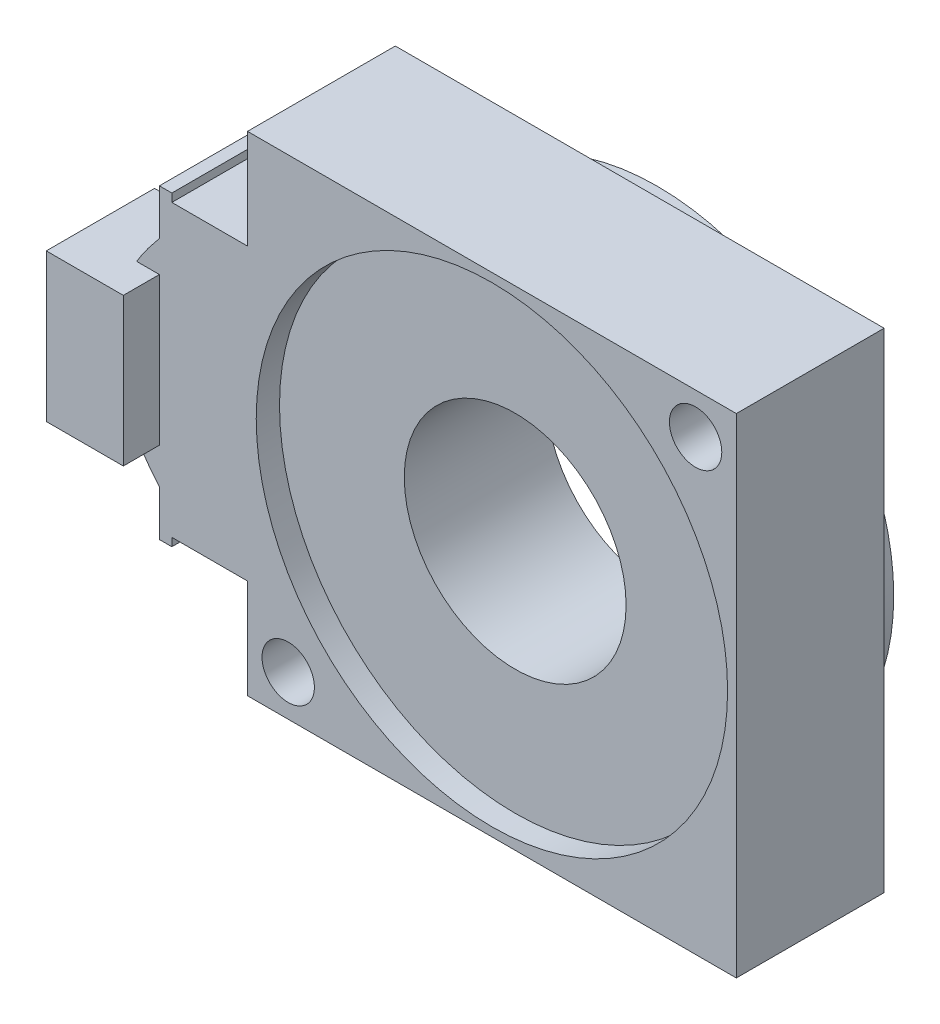
ISO-10303-21;
HEADER;
FILE_DESCRIPTION(('STEP AP214'),'2;1');
FILE_NAME('part.step','',(''),(''),'','','');
FILE_SCHEMA(('AUTOMOTIVE_DESIGN { 1 0 10303 214 1 1 1 1 }'));
ENDSEC;
DATA;
#1=APPLICATION_CONTEXT('core data for automotive mechanical design processes');
#2=APPLICATION_PROTOCOL_DEFINITION('international standard','automotive_design',2000,#1);
#3=PRODUCT_CONTEXT('',#1,'mechanical');
#4=PRODUCT('Part','Part','',(#3));
#5=PRODUCT_RELATED_PRODUCT_CATEGORY('part','',(#4));
#6=PRODUCT_DEFINITION_FORMATION('','',#4);
#7=PRODUCT_DEFINITION_CONTEXT('part definition',#1,'design');
#8=PRODUCT_DEFINITION('design','',#6,#7);
#9=PRODUCT_DEFINITION_SHAPE('','',#8);
#10=(LENGTH_UNIT() NAMED_UNIT(*) SI_UNIT(.MILLI.,.METRE.));
#11=(NAMED_UNIT(*) PLANE_ANGLE_UNIT() SI_UNIT($,.RADIAN.));
#12=(NAMED_UNIT(*) SI_UNIT($,.STERADIAN.) SOLID_ANGLE_UNIT());
#13=UNCERTAINTY_MEASURE_WITH_UNIT(LENGTH_MEASURE(1.E-05),#10,'distance_accuracy_value','');
#14=(GEOMETRIC_REPRESENTATION_CONTEXT(3) GLOBAL_UNCERTAINTY_ASSIGNED_CONTEXT((#13)) GLOBAL_UNIT_ASSIGNED_CONTEXT((#10,
#11,#12)) REPRESENTATION_CONTEXT('',''));
#15=CARTESIAN_POINT('',(0.,0.,0.));
#16=DIRECTION('',(0.,0.,1.));
#17=DIRECTION('',(1.,0.,0.));
#18=AXIS2_PLACEMENT_3D('',#15,#16,#17);
#19=CARTESIAN_POINT('',(0.,0.,12.7));
#20=DIRECTION('',(0.,0.,1.));
#21=DIRECTION('',(1.,0.,0.));
#22=AXIS2_PLACEMENT_3D('',#19,#20,#21);
#23=PLANE('',#22);
#24=CARTESIAN_POINT('',(0.,0.,12.7));
#25=DIRECTION('',(0.,0.,1.));
#26=DIRECTION('',(1.,0.,0.));
#27=AXIS2_PLACEMENT_3D('',#24,#25,#26);
#28=CIRCLE('',#27,20.25);
#29=CARTESIAN_POINT('',(20.25,0.,12.7));
#30=VERTEX_POINT('',#29);
#31=EDGE_CURVE('E241',#30,#30,#28,.T.);
#32=ORIENTED_EDGE('',*,*,#31,.F.);
#33=EDGE_LOOP('',(#32));
#34=FACE_BOUND('',#33,.T.);
#35=CARTESIAN_POINT('',(17.5008928343671,17.5008928343671,12.7));
#36=DIRECTION('',(0.,0.,1.));
#37=DIRECTION('',(1.,0.,0.));
#38=AXIS2_PLACEMENT_3D('',#35,#36,#37);
#39=CIRCLE('',#38,2.25);
#40=CARTESIAN_POINT('',(19.7508928343671,17.5008928343671,12.7));
#41=VERTEX_POINT('',#40);
#42=EDGE_CURVE('E462',#41,#41,#39,.T.);
#43=ORIENTED_EDGE('',*,*,#42,.F.);
#44=EDGE_LOOP('',(#43));
#45=FACE_BOUND('',#44,.T.);
#46=CARTESIAN_POINT('',(-17.5008928343671,-17.5008928343671,12.7));
#47=DIRECTION('',(0.,0.,1.));
#48=DIRECTION('',(-1.,0.,0.));
#49=AXIS2_PLACEMENT_3D('',#46,#47,#48);
#50=CIRCLE('',#49,2.25);
#51=CARTESIAN_POINT('',(-19.7508928343671,-17.5008928343671,12.7));
#52=VERTEX_POINT('',#51);
#53=EDGE_CURVE('E471',#52,#52,#50,.T.);
#54=ORIENTED_EDGE('',*,*,#53,.F.);
#55=EDGE_LOOP('',(#54));
#56=FACE_BOUND('',#55,.T.);
#57=CARTESIAN_POINT('',(-28.57,9.24089283436704,12.7));
#58=CARTESIAN_POINT('',(-36.45,0.,12.7));
#59=CARTESIAN_POINT('',(-28.57,-9.24089283436705,12.7));
#60=B_SPLINE_CURVE_WITH_KNOTS('',2,(#57,#58,#59),.UNSPECIFIED.,.F.,.F.,(3,3),(0.,1.),.UNSPECIFIED.);
#61=CARTESIAN_POINT('',(-28.57,9.24089283436704,12.7));
#62=VERTEX_POINT('',#61);
#63=CARTESIAN_POINT('',(-30.5239314132723,6.56089283436704,12.7));
#64=VERTEX_POINT('',#63);
#65=EDGE_CURVE('E396',#62,#64,#60,.T.);
#66=ORIENTED_EDGE('',*,*,#65,.T.);
#67=DIRECTION('',(1.,0.,0.));
#68=VECTOR('',#67,1.);
#69=CARTESIAN_POINT('',(0.,6.56089283436705,12.7));
#70=LINE('',#69,#68);
#71=CARTESIAN_POINT('',(-28.57,6.56089283436704,12.7));
#72=VERTEX_POINT('',#71);
#73=EDGE_CURVE('E228',#64,#72,#70,.T.);
#74=ORIENTED_EDGE('',*,*,#73,.T.);
#75=DIRECTION('',(0.,-1.,0.));
#76=VECTOR('',#75,1.);
#77=CARTESIAN_POINT('',(-28.57,0.,12.7));
#78=LINE('',#77,#76);
#79=CARTESIAN_POINT('',(-28.57,-6.13910716563296,12.7));
#80=VERTEX_POINT('',#79);
#81=EDGE_CURVE('E11',#72,#80,#78,.T.);
#82=ORIENTED_EDGE('',*,*,#81,.T.);
#83=DIRECTION('',(-1.,0.,0.));
#84=VECTOR('',#83,1.);
#85=CARTESIAN_POINT('',(0.,-6.13910716563296,12.7));
#86=LINE('',#85,#84);
#87=CARTESIAN_POINT('',(-30.7710832797259,-6.13910716563296,12.7));
#88=VERTEX_POINT('',#87);
#89=EDGE_CURVE('E224',#80,#88,#86,.T.);
#90=ORIENTED_EDGE('',*,*,#89,.T.);
#91=CARTESIAN_POINT('',(-28.57,-9.24089283436705,12.7));
#92=VERTEX_POINT('',#91);
#93=EDGE_CURVE('E404',#88,#92,#60,.T.);
#94=ORIENTED_EDGE('',*,*,#93,.T.);
#95=DIRECTION('',(0.,-1.,0.));
#96=VECTOR('',#95,1.);
#97=CARTESIAN_POINT('',(-28.57,-13.1608928343671,12.7));
#98=LINE('',#97,#96);
#99=CARTESIAN_POINT('',(-28.57,-13.1608928343671,12.7));
#100=VERTEX_POINT('',#99);
#101=EDGE_CURVE('E403',#92,#100,#98,.T.);
#102=ORIENTED_EDGE('',*,*,#101,.T.);
#103=DIRECTION('',(1.,0.,0.));
#104=VECTOR('',#103,1.);
#105=CARTESIAN_POINT('',(-27.5,-13.1608928343671,12.7));
#106=LINE('',#105,#104);
#107=CARTESIAN_POINT('',(-27.5,-13.1608928343671,12.7));
#108=VERTEX_POINT('',#107);
#109=EDGE_CURVE('E409',#100,#108,#106,.T.);
#110=ORIENTED_EDGE('',*,*,#109,.T.);
#111=DIRECTION('',(0.,1.,0.));
#112=VECTOR('',#111,1.);
#113=CARTESIAN_POINT('',(-27.5,-12.4608928343671,12.7));
#114=LINE('',#113,#112);
#115=CARTESIAN_POINT('',(-27.5,-12.4608928343671,12.7));
#116=VERTEX_POINT('',#115);
#117=EDGE_CURVE('E422',#108,#116,#114,.T.);
#118=ORIENTED_EDGE('',*,*,#117,.T.);
#119=DIRECTION('',(1.,0.,0.));
#120=VECTOR('',#119,1.);
#121=CARTESIAN_POINT('',(-21.,-12.4608928343671,12.7));
#122=LINE('',#121,#120);
#123=CARTESIAN_POINT('',(-21.,-12.4608928343671,12.7));
#124=VERTEX_POINT('',#123);
#125=EDGE_CURVE('E260',#116,#124,#122,.T.);
#126=ORIENTED_EDGE('',*,*,#125,.T.);
#127=DIRECTION('',(0.,-1.,0.));
#128=VECTOR('',#127,1.);
#129=CARTESIAN_POINT('',(-21.,21.,12.7));
#130=LINE('',#129,#128);
#131=CARTESIAN_POINT('',(-21.,-21.,12.7));
#132=VERTEX_POINT('',#131);
#133=EDGE_CURVE('E481',#124,#132,#130,.T.);
#134=ORIENTED_EDGE('',*,*,#133,.T.);
#135=DIRECTION('',(1.,0.,0.));
#136=VECTOR('',#135,1.);
#137=CARTESIAN_POINT('',(21.,-21.,12.7));
#138=LINE('',#137,#136);
#139=CARTESIAN_POINT('',(21.,-21.,12.7));
#140=VERTEX_POINT('',#139);
#141=EDGE_CURVE('E486',#132,#140,#138,.T.);
#142=ORIENTED_EDGE('',*,*,#141,.T.);
#143=DIRECTION('',(0.,1.,0.));
#144=VECTOR('',#143,1.);
#145=CARTESIAN_POINT('',(21.,21.,12.7));
#146=LINE('',#145,#144);
#147=CARTESIAN_POINT('',(21.,21.,12.7));
#148=VERTEX_POINT('',#147);
#149=EDGE_CURVE('E359',#140,#148,#146,.T.);
#150=ORIENTED_EDGE('',*,*,#149,.T.);
#151=DIRECTION('',(-1.,0.,0.));
#152=VECTOR('',#151,1.);
#153=CARTESIAN_POINT('',(0.,21.,12.7));
#154=LINE('',#153,#152);
#155=CARTESIAN_POINT('',(-21.,21.,12.7));
#156=VERTEX_POINT('',#155);
#157=EDGE_CURVE('E369',#148,#156,#154,.T.);
#158=ORIENTED_EDGE('',*,*,#157,.T.);
#159=CARTESIAN_POINT('',(-21.,12.4608928343671,12.7));
#160=VERTEX_POINT('',#159);
#161=EDGE_CURVE('E482',#156,#160,#130,.T.);
#162=ORIENTED_EDGE('',*,*,#161,.T.);
#163=DIRECTION('',(-1.,0.,0.));
#164=VECTOR('',#163,1.);
#165=CARTESIAN_POINT('',(-21.,12.460892834367,12.7));
#166=LINE('',#165,#164);
#167=CARTESIAN_POINT('',(-27.5,12.460892834367,12.7));
#168=VERTEX_POINT('',#167);
#169=EDGE_CURVE('E63',#160,#168,#166,.T.);
#170=ORIENTED_EDGE('',*,*,#169,.T.);
#171=DIRECTION('',(0.,1.,0.));
#172=VECTOR('',#171,1.);
#173=CARTESIAN_POINT('',(-27.5,12.460892834367,12.7));
#174=LINE('',#173,#172);
#175=CARTESIAN_POINT('',(-27.5,13.160892834367,12.7));
#176=VERTEX_POINT('',#175);
#177=EDGE_CURVE('E511',#168,#176,#174,.T.);
#178=ORIENTED_EDGE('',*,*,#177,.T.);
#179=DIRECTION('',(-1.,0.,0.));
#180=VECTOR('',#179,1.);
#181=CARTESIAN_POINT('',(-27.5,13.160892834367,12.7));
#182=LINE('',#181,#180);
#183=CARTESIAN_POINT('',(-28.57,13.160892834367,12.7));
#184=VERTEX_POINT('',#183);
#185=EDGE_CURVE('E514',#176,#184,#182,.T.);
#186=ORIENTED_EDGE('',*,*,#185,.T.);
#187=DIRECTION('',(0.,-1.,0.));
#188=VECTOR('',#187,1.);
#189=CARTESIAN_POINT('',(-28.57,13.160892834367,12.7));
#190=LINE('',#189,#188);
#191=EDGE_CURVE('E401',#184,#62,#190,.T.);
#192=ORIENTED_EDGE('',*,*,#191,.T.);
#193=EDGE_LOOP('',(#66,#74,#82,#90,#94,#102,#110,#118,#126,#134,#142,#150,#158,#162,#170,#178,
#186,#192));
#194=FACE_BOUND('',#193,.T.);
#195=ADVANCED_FACE('F39',(#34,#45,#56,#194),#23,.T.);
#196=CARTESIAN_POINT('',(-28.57,9.24089283436704,0.));
#197=CARTESIAN_POINT('',(-36.45,0.,0.));
#198=CARTESIAN_POINT('',(-28.57,-9.24089283436705,0.));
#199=B_SPLINE_CURVE_WITH_KNOTS('',2,(#196,#197,#198),.UNSPECIFIED.,.F.,.F.,(3,3),(0.,1.),.UNSPECIFIED.);
#200=DIRECTION('',(0.,0.,1.));
#201=VECTOR('',#200,1.);
#202=SURFACE_OF_LINEAR_EXTRUSION('',#199,#201);
#203=CARTESIAN_POINT('',(-28.57,9.24089283436704,6.5));
#204=CARTESIAN_POINT('',(-36.45,0.,6.5));
#205=CARTESIAN_POINT('',(-28.57,-9.24089283436705,6.5));
#206=B_SPLINE_CURVE_WITH_KNOTS('',2,(#203,#204,#205),.UNSPECIFIED.,.F.,.F.,(3,3),(0.,1.),.UNSPECIFIED.);
#207=CARTESIAN_POINT('',(-30.7710832797259,-6.13910716563296,6.5));
#208=VERTEX_POINT('',#207);
#209=CARTESIAN_POINT('',(-30.5239314132723,6.56089283436704,6.5));
#210=VERTEX_POINT('',#209);
#211=EDGE_CURVE('E246',#208,#210,#206,.F.);
#212=ORIENTED_EDGE('',*,*,#211,.T.);
#213=DIRECTION('',(0.,0.,1.));
#214=VECTOR('',#213,1.);
#215=CARTESIAN_POINT('',(-30.5239314132723,6.56089283436704,0.));
#216=LINE('',#215,#214);
#217=EDGE_CURVE('E48',#210,#64,#216,.T.);
#218=ORIENTED_EDGE('',*,*,#217,.T.);
#219=ORIENTED_EDGE('',*,*,#65,.F.);
#220=DIRECTION('',(0.,0.,1.));
#221=VECTOR('',#220,1.);
#222=CARTESIAN_POINT('',(-28.57,9.24089283436704,0.));
#223=LINE('',#222,#221);
#224=CARTESIAN_POINT('',(-28.57,9.24089283436704,0.));
#225=VERTEX_POINT('',#224);
#226=EDGE_CURVE('E446',#225,#62,#223,.T.);
#227=ORIENTED_EDGE('',*,*,#226,.F.);
#228=CARTESIAN_POINT('',(-28.57,-9.24089283436705,0.));
#229=VERTEX_POINT('',#228);
#230=EDGE_CURVE('E272',#225,#229,#199,.T.);
#231=ORIENTED_EDGE('',*,*,#230,.T.);
#232=DIRECTION('',(0.,0.,1.));
#233=VECTOR('',#232,1.);
#234=CARTESIAN_POINT('',(-28.57,-9.24089283436705,0.));
#235=LINE('',#234,#233);
#236=EDGE_CURVE('E442',#229,#92,#235,.T.);
#237=ORIENTED_EDGE('',*,*,#236,.T.);
#238=ORIENTED_EDGE('',*,*,#93,.F.);
#239=DIRECTION('',(0.,0.,1.));
#240=VECTOR('',#239,1.);
#241=CARTESIAN_POINT('',(-30.7710832797259,-6.13910716563296,0.));
#242=LINE('',#241,#240);
#243=EDGE_CURVE('E387',#88,#208,#242,.F.);
#244=ORIENTED_EDGE('',*,*,#243,.T.);
#245=EDGE_LOOP('',(#212,#218,#219,#227,#231,#237,#238,#244));
#246=FACE_BOUND('',#245,.T.);
#247=ADVANCED_FACE('F285',(#246),#202,.T.);
#248=CARTESIAN_POINT('',(-21.,21.,12.7));
#249=DIRECTION('',(1.,0.,0.));
#250=DIRECTION('',(0.,0.,-1.));
#251=AXIS2_PLACEMENT_3D('',#248,#249,#250);
#252=PLANE('',#251);
#253=DIRECTION('',(0.,0.,1.));
#254=VECTOR('',#253,1.);
#255=CARTESIAN_POINT('',(-21.,-12.4608928343671,0.));
#256=LINE('',#255,#254);
#257=CARTESIAN_POINT('',(-21.,-12.4608928343671,0.));
#258=VERTEX_POINT('',#257);
#259=EDGE_CURVE('E429',#258,#124,#256,.T.);
#260=ORIENTED_EDGE('',*,*,#259,.F.);
#261=DIRECTION('',(0.,-1.,0.));
#262=VECTOR('',#261,1.);
#263=CARTESIAN_POINT('',(-21.,21.,0.));
#264=LINE('',#263,#262);
#265=CARTESIAN_POINT('',(-21.,-21.,0.));
#266=VERTEX_POINT('',#265);
#267=EDGE_CURVE('E466',#258,#266,#264,.T.);
#268=ORIENTED_EDGE('',*,*,#267,.T.);
#269=DIRECTION('',(0.,0.,-1.));
#270=VECTOR('',#269,1.);
#271=CARTESIAN_POINT('',(-21.,-21.,12.7));
#272=LINE('',#271,#270);
#273=EDGE_CURVE('E348',#132,#266,#272,.T.);
#274=ORIENTED_EDGE('',*,*,#273,.F.);
#275=ORIENTED_EDGE('',*,*,#133,.F.);
#276=EDGE_LOOP('',(#260,#268,#274,#275));
#277=FACE_BOUND('',#276,.T.);
#278=ADVANCED_FACE('F289',(#277),#252,.F.);
#279=CARTESIAN_POINT('',(-21.,21.,0.));
#280=VERTEX_POINT('',#279);
#281=CARTESIAN_POINT('',(-21.,12.460892834367,0.));
#282=VERTEX_POINT('',#281);
#283=EDGE_CURVE('E354',#280,#282,#264,.T.);
#284=ORIENTED_EDGE('',*,*,#283,.T.);
#285=DIRECTION('',(0.,0.,1.));
#286=VECTOR('',#285,1.);
#287=CARTESIAN_POINT('',(-21.,12.460892834367,0.));
#288=LINE('',#287,#286);
#289=EDGE_CURVE('E458',#282,#160,#288,.T.);
#290=ORIENTED_EDGE('',*,*,#289,.T.);
#291=ORIENTED_EDGE('',*,*,#161,.F.);
#292=DIRECTION('',(0.,0.,-1.));
#293=VECTOR('',#292,1.);
#294=CARTESIAN_POINT('',(-21.,21.,12.7));
#295=LINE('',#294,#293);
#296=EDGE_CURVE('E247',#156,#280,#295,.T.);
#297=ORIENTED_EDGE('',*,*,#296,.T.);
#298=EDGE_LOOP('',(#284,#290,#291,#297));
#299=FACE_BOUND('',#298,.T.);
#300=ADVANCED_FACE('F41',(#299),#252,.F.);
#301=CARTESIAN_POINT('',(21.,-21.,12.7));
#302=DIRECTION('',(0.,1.,0.));
#303=DIRECTION('',(0.,0.,1.));
#304=AXIS2_PLACEMENT_3D('',#301,#302,#303);
#305=PLANE('',#304);
#306=DIRECTION('',(1.,0.,0.));
#307=VECTOR('',#306,1.);
#308=CARTESIAN_POINT('',(21.,-21.,0.));
#309=LINE('',#308,#307);
#310=CARTESIAN_POINT('',(21.,-21.,0.));
#311=VERTEX_POINT('',#310);
#312=EDGE_CURVE('E342',#266,#311,#309,.T.);
#313=ORIENTED_EDGE('',*,*,#312,.T.);
#314=DIRECTION('',(0.,0.,-1.));
#315=VECTOR('',#314,1.);
#316=CARTESIAN_POINT('',(21.,-21.,12.7));
#317=LINE('',#316,#315);
#318=EDGE_CURVE('E345',#140,#311,#317,.T.);
#319=ORIENTED_EDGE('',*,*,#318,.F.);
#320=ORIENTED_EDGE('',*,*,#141,.F.);
#321=ORIENTED_EDGE('',*,*,#273,.T.);
#322=EDGE_LOOP('',(#313,#319,#320,#321));
#323=FACE_BOUND('',#322,.T.);
#324=ADVANCED_FACE('F331',(#323),#305,.F.);
#325=CARTESIAN_POINT('',(21.,21.,12.7));
#326=DIRECTION('',(-1.,0.,0.));
#327=DIRECTION('',(0.,0.,1.));
#328=AXIS2_PLACEMENT_3D('',#325,#326,#327);
#329=PLANE('',#328);
#330=DIRECTION('',(0.,1.,0.));
#331=VECTOR('',#330,1.);
#332=CARTESIAN_POINT('',(21.,21.,0.));
#333=LINE('',#332,#331);
#334=CARTESIAN_POINT('',(21.,21.,0.));
#335=VERTEX_POINT('',#334);
#336=EDGE_CURVE('E353',#311,#335,#333,.T.);
#337=ORIENTED_EDGE('',*,*,#336,.T.);
#338=DIRECTION('',(0.,0.,-1.));
#339=VECTOR('',#338,1.);
#340=CARTESIAN_POINT('',(21.,21.,12.7));
#341=LINE('',#340,#339);
#342=EDGE_CURVE('E361',#148,#335,#341,.T.);
#343=ORIENTED_EDGE('',*,*,#342,.F.);
#344=ORIENTED_EDGE('',*,*,#149,.F.);
#345=ORIENTED_EDGE('',*,*,#318,.T.);
#346=EDGE_LOOP('',(#337,#343,#344,#345));
#347=FACE_BOUND('',#346,.T.);
#348=ADVANCED_FACE('F328',(#347),#329,.F.);
#349=CARTESIAN_POINT('',(0.,21.,12.7));
#350=DIRECTION('',(0.,-1.,0.));
#351=DIRECTION('',(0.,0.,-1.));
#352=AXIS2_PLACEMENT_3D('',#349,#350,#351);
#353=PLANE('',#352);
#354=DIRECTION('',(-1.,0.,0.));
#355=VECTOR('',#354,1.);
#356=CARTESIAN_POINT('',(0.,21.,0.));
#357=LINE('',#356,#355);
#358=EDGE_CURVE('E365',#335,#280,#357,.T.);
#359=ORIENTED_EDGE('',*,*,#358,.T.);
#360=ORIENTED_EDGE('',*,*,#296,.F.);
#361=ORIENTED_EDGE('',*,*,#157,.F.);
#362=ORIENTED_EDGE('',*,*,#342,.T.);
#363=EDGE_LOOP('',(#359,#360,#361,#362));
#364=FACE_BOUND('',#363,.T.);
#365=ADVANCED_FACE('F324',(#364),#353,.F.);
#366=CARTESIAN_POINT('',(0.,0.,0.));
#367=DIRECTION('',(0.,0.,1.));
#368=DIRECTION('',(1.,0.,0.));
#369=AXIS2_PLACEMENT_3D('',#366,#367,#368);
#370=PLANE('',#369);
#371=CARTESIAN_POINT('',(0.,0.,0.));
#372=DIRECTION('',(0.,0.,-1.));
#373=DIRECTION('',(-1.,0.,0.));
#374=AXIS2_PLACEMENT_3D('',#371,#372,#373);
#375=CIRCLE('',#374,20.325);
#376=CARTESIAN_POINT('',(-20.325,0.,0.));
#377=VERTEX_POINT('',#376);
#378=EDGE_CURVE('E242',#377,#377,#375,.T.);
#379=ORIENTED_EDGE('',*,*,#378,.F.);
#380=EDGE_LOOP('',(#379));
#381=FACE_BOUND('',#380,.T.);
#382=CARTESIAN_POINT('',(17.5008928343671,17.5008928343671,0.));
#383=DIRECTION('',(0.,0.,1.));
#384=DIRECTION('',(1.,0.,0.));
#385=AXIS2_PLACEMENT_3D('',#382,#383,#384);
#386=CIRCLE('',#385,2.25);
#387=CARTESIAN_POINT('',(19.7508928343671,17.5008928343671,0.));
#388=VERTEX_POINT('',#387);
#389=EDGE_CURVE('E467',#388,#388,#386,.T.);
#390=ORIENTED_EDGE('',*,*,#389,.T.);
#391=EDGE_LOOP('',(#390));
#392=FACE_BOUND('',#391,.T.);
#393=CARTESIAN_POINT('',(-17.5008928343671,-17.5008928343671,0.));
#394=DIRECTION('',(0.,0.,1.));
#395=DIRECTION('',(-1.,0.,0.));
#396=AXIS2_PLACEMENT_3D('',#393,#394,#395);
#397=CIRCLE('',#396,2.25);
#398=CARTESIAN_POINT('',(-19.7508928343671,-17.5008928343671,0.));
#399=VERTEX_POINT('',#398);
#400=EDGE_CURVE('E432',#399,#399,#397,.T.);
#401=ORIENTED_EDGE('',*,*,#400,.T.);
#402=EDGE_LOOP('',(#401));
#403=FACE_BOUND('',#402,.T.);
#404=ORIENTED_EDGE('',*,*,#283,.F.);
#405=ORIENTED_EDGE('',*,*,#358,.F.);
#406=ORIENTED_EDGE('',*,*,#336,.F.);
#407=ORIENTED_EDGE('',*,*,#312,.F.);
#408=ORIENTED_EDGE('',*,*,#267,.F.);
#409=DIRECTION('',(1.,0.,0.));
#410=VECTOR('',#409,1.);
#411=CARTESIAN_POINT('',(-21.,-12.4608928343671,0.));
#412=LINE('',#411,#410);
#413=CARTESIAN_POINT('',(-27.5,-12.4608928343671,0.));
#414=VERTEX_POINT('',#413);
#415=EDGE_CURVE('E461',#414,#258,#412,.T.);
#416=ORIENTED_EDGE('',*,*,#415,.F.);
#417=DIRECTION('',(0.,1.,0.));
#418=VECTOR('',#417,1.);
#419=CARTESIAN_POINT('',(-27.5,-12.4608928343671,0.));
#420=LINE('',#419,#418);
#421=CARTESIAN_POINT('',(-27.5,-13.1608928343671,0.));
#422=VERTEX_POINT('',#421);
#423=EDGE_CURVE('E500',#422,#414,#420,.T.);
#424=ORIENTED_EDGE('',*,*,#423,.F.);
#425=DIRECTION('',(1.,0.,0.));
#426=VECTOR('',#425,1.);
#427=CARTESIAN_POINT('',(-27.5,-13.1608928343671,0.));
#428=LINE('',#427,#426);
#429=CARTESIAN_POINT('',(-28.57,-13.1608928343671,0.));
#430=VERTEX_POINT('',#429);
#431=EDGE_CURVE('E506',#430,#422,#428,.T.);
#432=ORIENTED_EDGE('',*,*,#431,.F.);
#433=DIRECTION('',(0.,-1.,0.));
#434=VECTOR('',#433,1.);
#435=CARTESIAN_POINT('',(-28.57,-13.1608928343671,0.));
#436=LINE('',#435,#434);
#437=EDGE_CURVE('E279',#229,#430,#436,.T.);
#438=ORIENTED_EDGE('',*,*,#437,.F.);
#439=ORIENTED_EDGE('',*,*,#230,.F.);
#440=DIRECTION('',(0.,-1.,0.));
#441=VECTOR('',#440,1.);
#442=CARTESIAN_POINT('',(-28.57,13.160892834367,0.));
#443=LINE('',#442,#441);
#444=CARTESIAN_POINT('',(-28.57,13.160892834367,0.));
#445=VERTEX_POINT('',#444);
#446=EDGE_CURVE('E268',#445,#225,#443,.T.);
#447=ORIENTED_EDGE('',*,*,#446,.F.);
#448=DIRECTION('',(-1.,0.,0.));
#449=VECTOR('',#448,1.);
#450=CARTESIAN_POINT('',(-27.5,13.160892834367,0.));
#451=LINE('',#450,#449);
#452=CARTESIAN_POINT('',(-27.5,13.160892834367,0.));
#453=VERTEX_POINT('',#452);
#454=EDGE_CURVE('E264',#453,#445,#451,.T.);
#455=ORIENTED_EDGE('',*,*,#454,.F.);
#456=DIRECTION('',(0.,1.,0.));
#457=VECTOR('',#456,1.);
#458=CARTESIAN_POINT('',(-27.5,12.460892834367,0.));
#459=LINE('',#458,#457);
#460=CARTESIAN_POINT('',(-27.5,12.460892834367,0.));
#461=VERTEX_POINT('',#460);
#462=EDGE_CURVE('E259',#461,#453,#459,.T.);
#463=ORIENTED_EDGE('',*,*,#462,.F.);
#464=DIRECTION('',(-1.,0.,0.));
#465=VECTOR('',#464,1.);
#466=CARTESIAN_POINT('',(-21.,12.460892834367,0.));
#467=LINE('',#466,#465);
#468=EDGE_CURVE('E255',#282,#461,#467,.T.);
#469=ORIENTED_EDGE('',*,*,#468,.F.);
#470=EDGE_LOOP('',(#404,#405,#406,#407,#408,#416,#424,#432,#438,#439,#447,#455,#463,#469));
#471=FACE_BOUND('',#470,.T.);
#472=ADVANCED_FACE('F317',(#381,#392,#403,#471),#370,.F.);
#473=CARTESIAN_POINT('',(-17.5008928343671,-17.5008928343671,12.7));
#474=DIRECTION('',(0.,0.,-1.));
#475=DIRECTION('',(-1.,0.,0.));
#476=AXIS2_PLACEMENT_3D('',#473,#474,#475);
#477=CYLINDRICAL_SURFACE('',#476,2.25);
#478=ORIENTED_EDGE('',*,*,#53,.T.);
#479=EDGE_LOOP('',(#478));
#480=FACE_BOUND('',#479,.T.);
#481=ORIENTED_EDGE('',*,*,#400,.F.);
#482=EDGE_LOOP('',(#481));
#483=FACE_BOUND('',#482,.T.);
#484=ADVANCED_FACE('F313',(#480,#483),#477,.F.);
#485=CARTESIAN_POINT('',(17.5008928343671,17.5008928343671,12.7));
#486=DIRECTION('',(0.,0.,-1.));
#487=DIRECTION('',(-1.,0.,0.));
#488=AXIS2_PLACEMENT_3D('',#485,#486,#487);
#489=CYLINDRICAL_SURFACE('',#488,2.25);
#490=ORIENTED_EDGE('',*,*,#42,.T.);
#491=EDGE_LOOP('',(#490));
#492=FACE_BOUND('',#491,.T.);
#493=ORIENTED_EDGE('',*,*,#389,.F.);
#494=EDGE_LOOP('',(#493));
#495=FACE_BOUND('',#494,.T.);
#496=ADVANCED_FACE('F309',(#492,#495),#489,.F.);
#497=CARTESIAN_POINT('',(-21.,-12.4608928343671,0.));
#498=DIRECTION('',(0.,-1.,0.));
#499=DIRECTION('',(1.,0.,0.));
#500=AXIS2_PLACEMENT_3D('',#497,#498,#499);
#501=PLANE('',#500);
#502=ORIENTED_EDGE('',*,*,#125,.F.);
#503=DIRECTION('',(0.,0.,1.));
#504=VECTOR('',#503,1.);
#505=CARTESIAN_POINT('',(-27.5,-12.4608928343671,0.));
#506=LINE('',#505,#504);
#507=EDGE_CURVE('E433',#414,#116,#506,.T.);
#508=ORIENTED_EDGE('',*,*,#507,.F.);
#509=ORIENTED_EDGE('',*,*,#415,.T.);
#510=ORIENTED_EDGE('',*,*,#259,.T.);
#511=EDGE_LOOP('',(#502,#508,#509,#510));
#512=FACE_BOUND('',#511,.T.);
#513=ADVANCED_FACE('F312',(#512),#501,.T.);
#514=CARTESIAN_POINT('',(-27.5,-12.4608928343671,0.));
#515=DIRECTION('',(1.,0.,0.));
#516=DIRECTION('',(0.,0.,-1.));
#517=AXIS2_PLACEMENT_3D('',#514,#515,#516);
#518=PLANE('',#517);
#519=ORIENTED_EDGE('',*,*,#117,.F.);
#520=DIRECTION('',(0.,0.,1.));
#521=VECTOR('',#520,1.);
#522=CARTESIAN_POINT('',(-27.5,-13.1608928343671,0.));
#523=LINE('',#522,#521);
#524=EDGE_CURVE('E436',#422,#108,#523,.T.);
#525=ORIENTED_EDGE('',*,*,#524,.F.);
#526=ORIENTED_EDGE('',*,*,#423,.T.);
#527=ORIENTED_EDGE('',*,*,#507,.T.);
#528=EDGE_LOOP('',(#519,#525,#526,#527));
#529=FACE_BOUND('',#528,.T.);
#530=ADVANCED_FACE('F573',(#529),#518,.T.);
#531=CARTESIAN_POINT('',(-27.5,-13.1608928343671,0.));
#532=DIRECTION('',(0.,-1.,0.));
#533=DIRECTION('',(0.,0.,-1.));
#534=AXIS2_PLACEMENT_3D('',#531,#532,#533);
#535=PLANE('',#534);
#536=ORIENTED_EDGE('',*,*,#109,.F.);
#537=DIRECTION('',(0.,0.,1.));
#538=VECTOR('',#537,1.);
#539=CARTESIAN_POINT('',(-28.57,-13.1608928343671,0.));
#540=LINE('',#539,#538);
#541=EDGE_CURVE('E439',#430,#100,#540,.T.);
#542=ORIENTED_EDGE('',*,*,#541,.F.);
#543=ORIENTED_EDGE('',*,*,#431,.T.);
#544=ORIENTED_EDGE('',*,*,#524,.T.);
#545=EDGE_LOOP('',(#536,#542,#543,#544));
#546=FACE_BOUND('',#545,.T.);
#547=ADVANCED_FACE('F529',(#546),#535,.T.);
#548=CARTESIAN_POINT('',(-28.57,-13.1608928343671,0.));
#549=DIRECTION('',(-1.,0.,0.));
#550=DIRECTION('',(0.,0.,1.));
#551=AXIS2_PLACEMENT_3D('',#548,#549,#550);
#552=PLANE('',#551);
#553=ORIENTED_EDGE('',*,*,#101,.F.);
#554=ORIENTED_EDGE('',*,*,#236,.F.);
#555=ORIENTED_EDGE('',*,*,#437,.T.);
#556=ORIENTED_EDGE('',*,*,#541,.T.);
#557=EDGE_LOOP('',(#553,#554,#555,#556));
#558=FACE_BOUND('',#557,.T.);
#559=ADVANCED_FACE('F291',(#558),#552,.T.);
#560=CARTESIAN_POINT('',(-28.57,13.160892834367,0.));
#561=DIRECTION('',(-1.,0.,0.));
#562=DIRECTION('',(0.,0.,1.));
#563=AXIS2_PLACEMENT_3D('',#560,#561,#562);
#564=PLANE('',#563);
#565=ORIENTED_EDGE('',*,*,#191,.F.);
#566=DIRECTION('',(0.,0.,1.));
#567=VECTOR('',#566,1.);
#568=CARTESIAN_POINT('',(-28.57,13.160892834367,0.));
#569=LINE('',#568,#567);
#570=EDGE_CURVE('E449',#445,#184,#569,.T.);
#571=ORIENTED_EDGE('',*,*,#570,.F.);
#572=ORIENTED_EDGE('',*,*,#446,.T.);
#573=ORIENTED_EDGE('',*,*,#226,.T.);
#574=EDGE_LOOP('',(#565,#571,#572,#573));
#575=FACE_BOUND('',#574,.T.);
#576=ADVANCED_FACE('F293',(#575),#564,.T.);
#577=CARTESIAN_POINT('',(-27.5,13.160892834367,0.));
#578=DIRECTION('',(0.,1.,0.));
#579=DIRECTION('',(0.,0.,1.));
#580=AXIS2_PLACEMENT_3D('',#577,#578,#579);
#581=PLANE('',#580);
#582=ORIENTED_EDGE('',*,*,#185,.F.);
#583=DIRECTION('',(0.,0.,1.));
#584=VECTOR('',#583,1.);
#585=CARTESIAN_POINT('',(-27.5,13.160892834367,0.));
#586=LINE('',#585,#584);
#587=EDGE_CURVE('E452',#453,#176,#586,.T.);
#588=ORIENTED_EDGE('',*,*,#587,.F.);
#589=ORIENTED_EDGE('',*,*,#454,.T.);
#590=ORIENTED_EDGE('',*,*,#570,.T.);
#591=EDGE_LOOP('',(#582,#588,#589,#590));
#592=FACE_BOUND('',#591,.T.);
#593=ADVANCED_FACE('F296',(#592),#581,.T.);
#594=CARTESIAN_POINT('',(-27.5,12.460892834367,0.));
#595=DIRECTION('',(1.,0.,0.));
#596=DIRECTION('',(0.,0.,-1.));
#597=AXIS2_PLACEMENT_3D('',#594,#595,#596);
#598=PLANE('',#597);
#599=ORIENTED_EDGE('',*,*,#177,.F.);
#600=DIRECTION('',(0.,0.,1.));
#601=VECTOR('',#600,1.);
#602=CARTESIAN_POINT('',(-27.5,12.460892834367,0.));
#603=LINE('',#602,#601);
#604=EDGE_CURVE('E455',#461,#168,#603,.T.);
#605=ORIENTED_EDGE('',*,*,#604,.F.);
#606=ORIENTED_EDGE('',*,*,#462,.T.);
#607=ORIENTED_EDGE('',*,*,#587,.T.);
#608=EDGE_LOOP('',(#599,#605,#606,#607));
#609=FACE_BOUND('',#608,.T.);
#610=ADVANCED_FACE('F300',(#609),#598,.T.);
#611=CARTESIAN_POINT('',(-21.,12.460892834367,0.));
#612=DIRECTION('',(0.,1.,0.));
#613=DIRECTION('',(-1.,0.,0.));
#614=AXIS2_PLACEMENT_3D('',#611,#612,#613);
#615=PLANE('',#614);
#616=ORIENTED_EDGE('',*,*,#169,.F.);
#617=ORIENTED_EDGE('',*,*,#289,.F.);
#618=ORIENTED_EDGE('',*,*,#468,.T.);
#619=ORIENTED_EDGE('',*,*,#604,.T.);
#620=EDGE_LOOP('',(#616,#617,#618,#619));
#621=FACE_BOUND('',#620,.T.);
#622=ADVANCED_FACE('F304',(#621),#615,.T.);
#623=CARTESIAN_POINT('',(0.,0.,10.7));
#624=DIRECTION('',(0.,0.,1.));
#625=DIRECTION('',(1.,0.,0.));
#626=AXIS2_PLACEMENT_3D('',#623,#624,#625);
#627=CYLINDRICAL_SURFACE('',#626,20.25);
#628=CARTESIAN_POINT('',(0.,0.,10.7));
#629=DIRECTION('',(0.,0.,1.));
#630=DIRECTION('',(1.,0.,0.));
#631=AXIS2_PLACEMENT_3D('',#628,#629,#630);
#632=CIRCLE('',#631,20.25);
#633=CARTESIAN_POINT('',(20.25,0.,10.7));
#634=VERTEX_POINT('',#633);
#635=EDGE_CURVE('E248',#634,#634,#632,.T.);
#636=ORIENTED_EDGE('',*,*,#635,.F.);
#637=EDGE_LOOP('',(#636));
#638=FACE_BOUND('',#637,.T.);
#639=ORIENTED_EDGE('',*,*,#31,.T.);
#640=EDGE_LOOP('',(#639));
#641=FACE_BOUND('',#640,.T.);
#642=ADVANCED_FACE('F308',(#638,#641),#627,.F.);
#643=CARTESIAN_POINT('',(0.,0.,10.7));
#644=DIRECTION('',(0.,0.,1.));
#645=DIRECTION('',(1.,0.,0.));
#646=AXIS2_PLACEMENT_3D('',#643,#644,#645);
#647=PLANE('',#646);
#648=CARTESIAN_POINT('',(0.,0.,10.7));
#649=DIRECTION('',(0.,0.,1.));
#650=DIRECTION('',(1.,0.,0.));
#651=AXIS2_PLACEMENT_3D('',#648,#649,#650);
#652=CIRCLE('',#651,9.53);
#653=CARTESIAN_POINT('',(9.53,0.,10.7));
#654=VERTEX_POINT('',#653);
#655=EDGE_CURVE('E232',#654,#654,#652,.T.);
#656=ORIENTED_EDGE('',*,*,#655,.F.);
#657=EDGE_LOOP('',(#656));
#658=FACE_BOUND('',#657,.T.);
#659=ORIENTED_EDGE('',*,*,#635,.T.);
#660=EDGE_LOOP('',(#659));
#661=FACE_BOUND('',#660,.T.);
#662=ADVANCED_FACE('F563',(#658,#661),#647,.T.);
#663=CARTESIAN_POINT('',(0.,0.,-1.5));
#664=DIRECTION('',(0.,0.,1.));
#665=DIRECTION('',(1.,0.,0.));
#666=AXIS2_PLACEMENT_3D('',#663,#664,#665);
#667=CYLINDRICAL_SURFACE('',#666,20.325);
#668=CARTESIAN_POINT('',(0.,0.,-1.5));
#669=DIRECTION('',(0.,0.,-1.));
#670=DIRECTION('',(-1.,0.,0.));
#671=AXIS2_PLACEMENT_3D('',#668,#669,#670);
#672=CIRCLE('',#671,20.325);
#673=CARTESIAN_POINT('',(-20.325,0.,-1.5));
#674=VERTEX_POINT('',#673);
#675=EDGE_CURVE('E237',#674,#674,#672,.T.);
#676=ORIENTED_EDGE('',*,*,#675,.F.);
#677=EDGE_LOOP('',(#676));
#678=FACE_BOUND('',#677,.T.);
#679=ORIENTED_EDGE('',*,*,#378,.T.);
#680=EDGE_LOOP('',(#679));
#681=FACE_BOUND('',#680,.T.);
#682=ADVANCED_FACE('F559',(#678,#681),#667,.T.);
#683=CARTESIAN_POINT('',(0.,0.,-1.5));
#684=DIRECTION('',(0.,0.,-1.));
#685=DIRECTION('',(-1.,0.,0.));
#686=AXIS2_PLACEMENT_3D('',#683,#684,#685);
#687=PLANE('',#686);
#688=CARTESIAN_POINT('',(0.,0.,-1.5));
#689=DIRECTION('',(0.,0.,-1.));
#690=DIRECTION('',(-1.,0.,0.));
#691=AXIS2_PLACEMENT_3D('',#688,#689,#690);
#692=CIRCLE('',#691,9.53);
#693=CARTESIAN_POINT('',(-9.53,0.,-1.5));
#694=VERTEX_POINT('',#693);
#695=EDGE_CURVE('E236',#694,#694,#692,.T.);
#696=ORIENTED_EDGE('',*,*,#695,.F.);
#697=EDGE_LOOP('',(#696));
#698=FACE_BOUND('',#697,.T.);
#699=ORIENTED_EDGE('',*,*,#675,.T.);
#700=EDGE_LOOP('',(#699));
#701=FACE_BOUND('',#700,.T.);
#702=ADVANCED_FACE('F552',(#698,#701),#687,.T.);
#703=CARTESIAN_POINT('',(0.,0.,-19.3));
#704=DIRECTION('',(0.,0.,1.));
#705=DIRECTION('',(1.,0.,0.));
#706=AXIS2_PLACEMENT_3D('',#703,#704,#705);
#707=CYLINDRICAL_SURFACE('',#706,9.53);
#708=ORIENTED_EDGE('',*,*,#695,.T.);
#709=EDGE_LOOP('',(#708));
#710=FACE_BOUND('',#709,.T.);
#711=ORIENTED_EDGE('',*,*,#655,.T.);
#712=EDGE_LOOP('',(#711));
#713=FACE_BOUND('',#712,.T.);
#714=ADVANCED_FACE('F544',(#710,#713),#707,.F.);
#715=CARTESIAN_POINT('',(-28.57,-6.13910716563296,15.8));
#716=DIRECTION('',(-1.,0.,0.));
#717=DIRECTION('',(0.,0.,1.));
#718=AXIS2_PLACEMENT_3D('',#715,#716,#717);
#719=PLANE('',#718);
#720=ORIENTED_EDGE('',*,*,#81,.F.);
#721=DIRECTION('',(0.,0.,-1.));
#722=VECTOR('',#721,1.);
#723=CARTESIAN_POINT('',(-28.57,6.56089283436704,15.8));
#724=LINE('',#723,#722);
#725=CARTESIAN_POINT('',(-28.57,6.56089283436704,15.8));
#726=VERTEX_POINT('',#725);
#727=EDGE_CURVE('E192',#726,#72,#724,.T.);
#728=ORIENTED_EDGE('',*,*,#727,.F.);
#729=DIRECTION('',(0.,1.,0.));
#730=VECTOR('',#729,1.);
#731=CARTESIAN_POINT('',(-28.57,-6.13910716563296,15.8));
#732=LINE('',#731,#730);
#733=CARTESIAN_POINT('',(-28.57,-6.13910716563296,15.8));
#734=VERTEX_POINT('',#733);
#735=EDGE_CURVE('E201',#734,#726,#732,.T.);
#736=ORIENTED_EDGE('',*,*,#735,.F.);
#737=DIRECTION('',(0.,0.,-1.));
#738=VECTOR('',#737,1.);
#739=CARTESIAN_POINT('',(-28.57,-6.13910716563296,15.8));
#740=LINE('',#739,#738);
#741=EDGE_CURVE('E215',#734,#80,#740,.T.);
#742=ORIENTED_EDGE('',*,*,#741,.T.);
#743=EDGE_LOOP('',(#720,#728,#736,#742));
#744=FACE_BOUND('',#743,.T.);
#745=ADVANCED_FACE('F542',(#744),#719,.F.);
#746=CARTESIAN_POINT('',(-28.57,6.56089283436704,15.8));
#747=DIRECTION('',(0.,-1.,0.));
#748=DIRECTION('',(1.,0.,0.));
#749=AXIS2_PLACEMENT_3D('',#746,#747,#748);
#750=PLANE('',#749);
#751=ORIENTED_EDGE('',*,*,#73,.F.);
#752=ORIENTED_EDGE('',*,*,#217,.F.);
#753=DIRECTION('',(-1.,0.,0.));
#754=VECTOR('',#753,1.);
#755=CARTESIAN_POINT('',(-28.57,6.56089283436704,6.5));
#756=LINE('',#755,#754);
#757=CARTESIAN_POINT('',(-35.19,6.56089283436704,6.5));
#758=VERTEX_POINT('',#757);
#759=EDGE_CURVE('E55',#210,#758,#756,.T.);
#760=ORIENTED_EDGE('',*,*,#759,.T.);
#761=DIRECTION('',(0.,0.,-1.));
#762=VECTOR('',#761,1.);
#763=CARTESIAN_POINT('',(-35.19,6.56089283436704,15.8));
#764=LINE('',#763,#762);
#765=CARTESIAN_POINT('',(-35.19,6.56089283436704,15.8));
#766=VERTEX_POINT('',#765);
#767=EDGE_CURVE('E178',#766,#758,#764,.T.);
#768=ORIENTED_EDGE('',*,*,#767,.F.);
#769=DIRECTION('',(-1.,0.,0.));
#770=VECTOR('',#769,1.);
#771=CARTESIAN_POINT('',(-28.57,6.56089283436704,15.8));
#772=LINE('',#771,#770);
#773=EDGE_CURVE('E207',#726,#766,#772,.T.);
#774=ORIENTED_EDGE('',*,*,#773,.F.);
#775=ORIENTED_EDGE('',*,*,#727,.T.);
#776=EDGE_LOOP('',(#751,#752,#760,#768,#774,#775));
#777=FACE_BOUND('',#776,.T.);
#778=ADVANCED_FACE('F177',(#777),#750,.F.);
#779=CARTESIAN_POINT('',(-35.19,6.56089283436704,15.8));
#780=DIRECTION('',(1.,0.,0.));
#781=DIRECTION('',(0.,0.,-1.));
#782=AXIS2_PLACEMENT_3D('',#779,#780,#781);
#783=PLANE('',#782);
#784=ORIENTED_EDGE('',*,*,#767,.T.);
#785=DIRECTION('',(0.,-1.,0.));
#786=VECTOR('',#785,1.);
#787=CARTESIAN_POINT('',(-35.19,6.56089283436704,6.5));
#788=LINE('',#787,#786);
#789=CARTESIAN_POINT('',(-35.19,-6.13910716563296,6.5));
#790=VERTEX_POINT('',#789);
#791=EDGE_CURVE('E183',#758,#790,#788,.T.);
#792=ORIENTED_EDGE('',*,*,#791,.T.);
#793=DIRECTION('',(0.,0.,-1.));
#794=VECTOR('',#793,1.);
#795=CARTESIAN_POINT('',(-35.19,-6.13910716563296,15.8));
#796=LINE('',#795,#794);
#797=CARTESIAN_POINT('',(-35.19,-6.13910716563296,15.8));
#798=VERTEX_POINT('',#797);
#799=EDGE_CURVE('E193',#798,#790,#796,.T.);
#800=ORIENTED_EDGE('',*,*,#799,.F.);
#801=DIRECTION('',(0.,-1.,0.));
#802=VECTOR('',#801,1.);
#803=CARTESIAN_POINT('',(-35.19,6.56089283436704,15.8));
#804=LINE('',#803,#802);
#805=EDGE_CURVE('E190',#766,#798,#804,.T.);
#806=ORIENTED_EDGE('',*,*,#805,.F.);
#807=EDGE_LOOP('',(#784,#792,#800,#806));
#808=FACE_BOUND('',#807,.T.);
#809=ADVANCED_FACE('F187',(#808),#783,.F.);
#810=CARTESIAN_POINT('',(-35.19,-6.13910716563296,15.8));
#811=DIRECTION('',(0.,1.,0.));
#812=DIRECTION('',(0.,0.,1.));
#813=AXIS2_PLACEMENT_3D('',#810,#811,#812);
#814=PLANE('',#813);
#815=ORIENTED_EDGE('',*,*,#89,.F.);
#816=ORIENTED_EDGE('',*,*,#741,.F.);
#817=DIRECTION('',(1.,0.,0.));
#818=VECTOR('',#817,1.);
#819=CARTESIAN_POINT('',(-35.19,-6.13910716563296,15.8));
#820=LINE('',#819,#818);
#821=EDGE_CURVE('E212',#798,#734,#820,.T.);
#822=ORIENTED_EDGE('',*,*,#821,.F.);
#823=ORIENTED_EDGE('',*,*,#799,.T.);
#824=DIRECTION('',(1.,0.,0.));
#825=VECTOR('',#824,1.);
#826=CARTESIAN_POINT('',(-35.19,-6.13910716563296,6.5));
#827=LINE('',#826,#825);
#828=EDGE_CURVE('E197',#790,#208,#827,.T.);
#829=ORIENTED_EDGE('',*,*,#828,.T.);
#830=ORIENTED_EDGE('',*,*,#243,.F.);
#831=EDGE_LOOP('',(#815,#816,#822,#823,#829,#830));
#832=FACE_BOUND('',#831,.T.);
#833=ADVANCED_FACE('F534',(#832),#814,.F.);
#834=CARTESIAN_POINT('',(0.,0.,15.8));
#835=DIRECTION('',(0.,0.,1.));
#836=DIRECTION('',(1.,0.,0.));
#837=AXIS2_PLACEMENT_3D('',#834,#835,#836);
#838=PLANE('',#837);
#839=ORIENTED_EDGE('',*,*,#735,.T.);
#840=ORIENTED_EDGE('',*,*,#773,.T.);
#841=ORIENTED_EDGE('',*,*,#805,.T.);
#842=ORIENTED_EDGE('',*,*,#821,.T.);
#843=EDGE_LOOP('',(#839,#840,#841,#842));
#844=FACE_BOUND('',#843,.T.);
#845=ADVANCED_FACE('F539',(#844),#838,.T.);
#846=CARTESIAN_POINT('',(0.,0.,6.5));
#847=DIRECTION('',(0.,0.,1.));
#848=DIRECTION('',(1.,0.,0.));
#849=AXIS2_PLACEMENT_3D('',#846,#847,#848);
#850=PLANE('',#849);
#851=ORIENTED_EDGE('',*,*,#211,.F.);
#852=ORIENTED_EDGE('',*,*,#828,.F.);
#853=ORIENTED_EDGE('',*,*,#791,.F.);
#854=ORIENTED_EDGE('',*,*,#759,.F.);
#855=EDGE_LOOP('',(#851,#852,#853,#854));
#856=FACE_BOUND('',#855,.T.);
#857=ADVANCED_FACE('F195',(#856),#850,.F.);
#858=CLOSED_SHELL('',(#195,#247,#278,#300,#324,#348,#365,#472,#484,#496,#513,#530,#547,#559,
#576,#593,#610,#622,#642,#662,#682,#702,#714,#745,#778,#809,#833,#845,#857));
#859=MANIFOLD_SOLID_BREP('B2',#858);
#860=ADVANCED_BREP_SHAPE_REPRESENTATION('',(#18,#859),#14);
#861=SHAPE_DEFINITION_REPRESENTATION(#9,#860);
ENDSEC;
END-ISO-10303-21;
